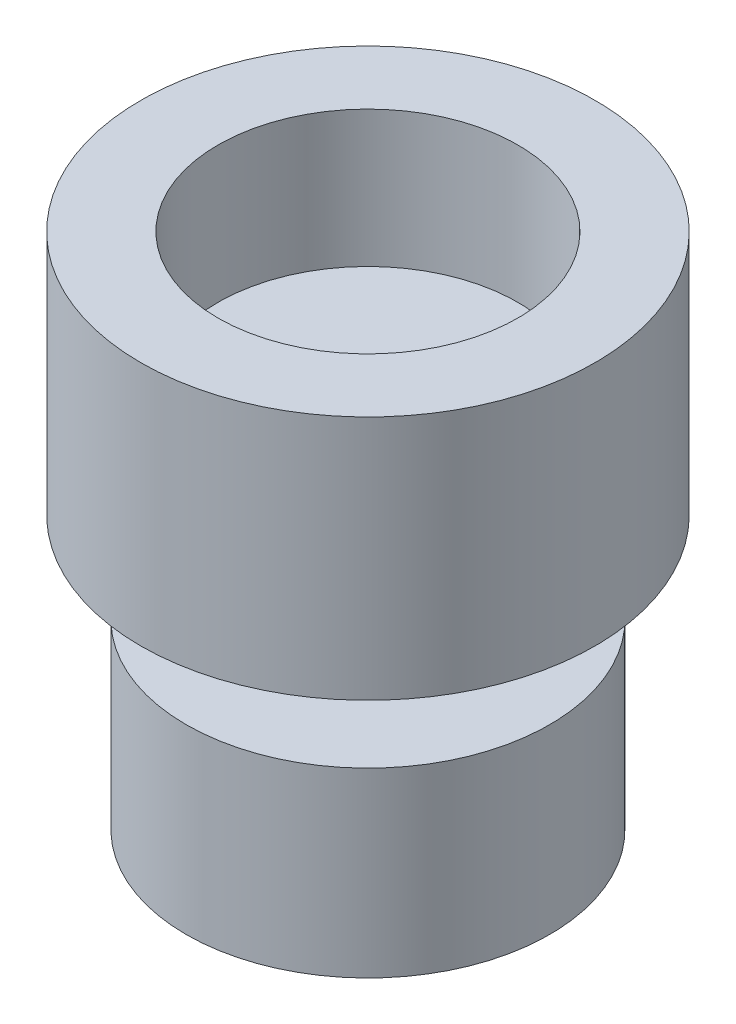
ISO-10303-21;
HEADER;
FILE_DESCRIPTION(('STEP AP214'),'2;1');
FILE_NAME('part.step','',(''),(''),'','','');
FILE_SCHEMA(('AUTOMOTIVE_DESIGN { 1 0 10303 214 1 1 1 1 }'));
ENDSEC;
DATA;
#1=APPLICATION_CONTEXT('core data for automotive mechanical design processes');
#2=APPLICATION_PROTOCOL_DEFINITION('international standard','automotive_design',2000,#1);
#3=PRODUCT_CONTEXT('',#1,'mechanical');
#4=PRODUCT('Part','Part','',(#3));
#5=PRODUCT_RELATED_PRODUCT_CATEGORY('part','',(#4));
#6=PRODUCT_DEFINITION_FORMATION('','',#4);
#7=PRODUCT_DEFINITION_CONTEXT('part definition',#1,'design');
#8=PRODUCT_DEFINITION('design','',#6,#7);
#9=PRODUCT_DEFINITION_SHAPE('','',#8);
#10=(LENGTH_UNIT() NAMED_UNIT(*) SI_UNIT(.MILLI.,.METRE.));
#11=(NAMED_UNIT(*) PLANE_ANGLE_UNIT() SI_UNIT($,.RADIAN.));
#12=(NAMED_UNIT(*) SI_UNIT($,.STERADIAN.) SOLID_ANGLE_UNIT());
#13=UNCERTAINTY_MEASURE_WITH_UNIT(LENGTH_MEASURE(1.E-05),#10,'distance_accuracy_value','');
#14=(GEOMETRIC_REPRESENTATION_CONTEXT(3) GLOBAL_UNCERTAINTY_ASSIGNED_CONTEXT((#13)) GLOBAL_UNIT_ASSIGNED_CONTEXT((#10,
#11,#12)) REPRESENTATION_CONTEXT('',''));
#15=CARTESIAN_POINT('',(0.,0.,0.));
#16=DIRECTION('',(0.,0.,1.));
#17=DIRECTION('',(1.,0.,0.));
#18=AXIS2_PLACEMENT_3D('',#15,#16,#17);
#19=CARTESIAN_POINT('',(-0.522013311509166,2.7,-0.51113803418606));
#20=DIRECTION('',(0.,-1.,0.));
#21=DIRECTION('',(0.,0.,-1.));
#22=AXIS2_PLACEMENT_3D('',#19,#20,#21);
#23=CYLINDRICAL_SURFACE('',#22,2.5);
#24=CARTESIAN_POINT('',(-0.522013311509166,2.7,-0.51113803418606));
#25=DIRECTION('',(0.,1.,0.));
#26=DIRECTION('',(0.,0.,1.));
#27=AXIS2_PLACEMENT_3D('',#24,#25,#26);
#28=CIRCLE('',#27,2.5);
#29=CARTESIAN_POINT('',(-0.522013311509166,2.7,1.98886196581394));
#30=VERTEX_POINT('',#29);
#31=EDGE_CURVE('E50',#30,#30,#28,.T.);
#32=ORIENTED_EDGE('',*,*,#31,.F.);
#33=EDGE_LOOP('',(#32));
#34=FACE_BOUND('',#33,.T.);
#35=CARTESIAN_POINT('',(-0.522013311509166,0.,-0.51113803418606));
#36=DIRECTION('',(0.,1.,0.));
#37=DIRECTION('',(0.,0.,1.));
#38=AXIS2_PLACEMENT_3D('',#35,#36,#37);
#39=CIRCLE('',#38,2.5);
#40=CARTESIAN_POINT('',(-0.522013311509166,0.,1.98886196581394));
#41=VERTEX_POINT('',#40);
#42=EDGE_CURVE('E46',#41,#41,#39,.T.);
#43=ORIENTED_EDGE('',*,*,#42,.T.);
#44=EDGE_LOOP('',(#43));
#45=FACE_BOUND('',#44,.T.);
#46=ADVANCED_FACE('F43',(#34,#45),#23,.T.);
#47=CARTESIAN_POINT('',(-0.522013311509166,2.7,-0.51113803418606));
#48=DIRECTION('',(0.,1.,0.));
#49=DIRECTION('',(0.,0.,1.));
#50=AXIS2_PLACEMENT_3D('',#47,#48,#49);
#51=PLANE('',#50);
#52=CARTESIAN_POINT('',(-0.522013311509166,2.7,-0.51113803418606));
#53=DIRECTION('',(0.,1.,0.));
#54=DIRECTION('',(0.,0.,1.));
#55=AXIS2_PLACEMENT_3D('',#52,#53,#54);
#56=CIRCLE('',#55,1.65);
#57=CARTESIAN_POINT('',(-0.522013311509166,2.7,1.13886196581394));
#58=VERTEX_POINT('',#57);
#59=EDGE_CURVE('E66',#58,#58,#56,.T.);
#60=ORIENTED_EDGE('',*,*,#59,.F.);
#61=EDGE_LOOP('',(#60));
#62=FACE_BOUND('',#61,.T.);
#63=ORIENTED_EDGE('',*,*,#31,.T.);
#64=EDGE_LOOP('',(#63));
#65=FACE_BOUND('',#64,.T.);
#66=ADVANCED_FACE('F81',(#62,#65),#51,.T.);
#67=CARTESIAN_POINT('',(-0.522013311509166,0.,-0.51113803418606));
#68=DIRECTION('',(0.,1.,0.));
#69=DIRECTION('',(0.,0.,1.));
#70=AXIS2_PLACEMENT_3D('',#67,#68,#69);
#71=PLANE('',#70);
#72=CARTESIAN_POINT('',(-0.522013311509166,0.,-0.51113803418606));
#73=DIRECTION('',(0.,-1.,0.));
#74=DIRECTION('',(0.,0.,-1.));
#75=AXIS2_PLACEMENT_3D('',#72,#73,#74);
#76=CIRCLE('',#75,1.);
#77=CARTESIAN_POINT('',(-0.522013311509166,0.,-1.51113803418606));
#78=VERTEX_POINT('',#77);
#79=EDGE_CURVE('E10',#78,#78,#76,.T.);
#80=ORIENTED_EDGE('',*,*,#79,.F.);
#81=EDGE_LOOP('',(#80));
#82=FACE_BOUND('',#81,.T.);
#83=ORIENTED_EDGE('',*,*,#42,.F.);
#84=EDGE_LOOP('',(#83));
#85=FACE_BOUND('',#84,.T.);
#86=ADVANCED_FACE('F84',(#82,#85),#71,.F.);
#87=CARTESIAN_POINT('',(-0.522013311509166,-1.,-0.51113803418606));
#88=DIRECTION('',(0.,1.,0.));
#89=DIRECTION('',(0.,0.,1.));
#90=AXIS2_PLACEMENT_3D('',#87,#88,#89);
#91=CYLINDRICAL_SURFACE('',#90,1.);
#92=CARTESIAN_POINT('',(-0.522013311509166,-1.,-0.51113803418606));
#93=DIRECTION('',(0.,-1.,0.));
#94=DIRECTION('',(0.,0.,-1.));
#95=AXIS2_PLACEMENT_3D('',#92,#93,#94);
#96=CIRCLE('',#95,1.);
#97=CARTESIAN_POINT('',(-0.522013311509166,-1.,-1.51113803418606));
#98=VERTEX_POINT('',#97);
#99=EDGE_CURVE('E56',#98,#98,#96,.T.);
#100=ORIENTED_EDGE('',*,*,#99,.F.);
#101=EDGE_LOOP('',(#100));
#102=FACE_BOUND('',#101,.T.);
#103=ORIENTED_EDGE('',*,*,#79,.T.);
#104=EDGE_LOOP('',(#103));
#105=FACE_BOUND('',#104,.T.);
#106=ADVANCED_FACE('F94',(#102,#105),#91,.T.);
#107=CARTESIAN_POINT('',(-0.522013311509166,-3.,-0.51113803418606));
#108=DIRECTION('',(0.,1.,0.));
#109=DIRECTION('',(0.,0.,1.));
#110=AXIS2_PLACEMENT_3D('',#107,#108,#109);
#111=CYLINDRICAL_SURFACE('',#110,2.);
#112=CARTESIAN_POINT('',(-0.522013311509166,-3.,-0.51113803418606));
#113=DIRECTION('',(0.,-1.,0.));
#114=DIRECTION('',(0.,0.,-1.));
#115=AXIS2_PLACEMENT_3D('',#112,#113,#114);
#116=CIRCLE('',#115,2.);
#117=CARTESIAN_POINT('',(-0.522013311509166,-3.,-2.51113803418606));
#118=VERTEX_POINT('',#117);
#119=EDGE_CURVE('E59',#118,#118,#116,.T.);
#120=ORIENTED_EDGE('',*,*,#119,.F.);
#121=EDGE_LOOP('',(#120));
#122=FACE_BOUND('',#121,.T.);
#123=CARTESIAN_POINT('',(-0.522013311509166,-1.,-0.51113803418606));
#124=DIRECTION('',(0.,-1.,0.));
#125=DIRECTION('',(0.,0.,-1.));
#126=AXIS2_PLACEMENT_3D('',#123,#124,#125);
#127=CIRCLE('',#126,2.);
#128=CARTESIAN_POINT('',(-0.522013311509166,-1.,-2.51113803418606));
#129=VERTEX_POINT('',#128);
#130=EDGE_CURVE('E60',#129,#129,#127,.T.);
#131=ORIENTED_EDGE('',*,*,#130,.T.);
#132=EDGE_LOOP('',(#131));
#133=FACE_BOUND('',#132,.T.);
#134=ADVANCED_FACE('F99',(#122,#133),#111,.T.);
#135=CARTESIAN_POINT('',(-0.522013311509166,-3.,-0.51113803418606));
#136=DIRECTION('',(0.,-1.,0.));
#137=DIRECTION('',(0.,0.,-1.));
#138=AXIS2_PLACEMENT_3D('',#135,#136,#137);
#139=PLANE('',#138);
#140=ORIENTED_EDGE('',*,*,#119,.T.);
#141=EDGE_LOOP('',(#140));
#142=FACE_BOUND('',#141,.T.);
#143=ADVANCED_FACE('F105',(#142),#139,.T.);
#144=CARTESIAN_POINT('',(-0.522013311509166,-1.,-0.51113803418606));
#145=DIRECTION('',(0.,-1.,0.));
#146=DIRECTION('',(0.,0.,-1.));
#147=AXIS2_PLACEMENT_3D('',#144,#145,#146);
#148=PLANE('',#147);
#149=ORIENTED_EDGE('',*,*,#99,.T.);
#150=EDGE_LOOP('',(#149));
#151=FACE_BOUND('',#150,.T.);
#152=ORIENTED_EDGE('',*,*,#130,.F.);
#153=EDGE_LOOP('',(#152));
#154=FACE_BOUND('',#153,.T.);
#155=ADVANCED_FACE('F77',(#151,#154),#148,.F.);
#156=CARTESIAN_POINT('',(-0.522013311509166,1.2,-0.51113803418606));
#157=DIRECTION('',(0.,1.,0.));
#158=DIRECTION('',(0.,0.,1.));
#159=AXIS2_PLACEMENT_3D('',#156,#157,#158);
#160=CYLINDRICAL_SURFACE('',#159,1.65);
#161=CARTESIAN_POINT('',(-0.522013311509166,1.2,-0.51113803418606));
#162=DIRECTION('',(0.,1.,0.));
#163=DIRECTION('',(0.,0.,1.));
#164=AXIS2_PLACEMENT_3D('',#161,#162,#163);
#165=CIRCLE('',#164,1.65);
#166=CARTESIAN_POINT('',(-0.522013311509166,1.2,1.13886196581394));
#167=VERTEX_POINT('',#166);
#168=EDGE_CURVE('E63',#167,#167,#165,.T.);
#169=ORIENTED_EDGE('',*,*,#168,.F.);
#170=EDGE_LOOP('',(#169));
#171=FACE_BOUND('',#170,.T.);
#172=ORIENTED_EDGE('',*,*,#59,.T.);
#173=EDGE_LOOP('',(#172));
#174=FACE_BOUND('',#173,.T.);
#175=ADVANCED_FACE('F74',(#171,#174),#160,.F.);
#176=CARTESIAN_POINT('',(-0.522013311509166,1.2,-0.51113803418606));
#177=DIRECTION('',(0.,1.,0.));
#178=DIRECTION('',(0.,0.,1.));
#179=AXIS2_PLACEMENT_3D('',#176,#177,#178);
#180=PLANE('',#179);
#181=ORIENTED_EDGE('',*,*,#168,.T.);
#182=EDGE_LOOP('',(#181));
#183=FACE_BOUND('',#182,.T.);
#184=ADVANCED_FACE('F72',(#183),#180,.T.);
#185=CLOSED_SHELL('',(#46,#66,#86,#106,#134,#143,#155,#175,#184));
#186=MANIFOLD_SOLID_BREP('B2',#185);
#187=ADVANCED_BREP_SHAPE_REPRESENTATION('',(#18,#186),#14);
#188=SHAPE_DEFINITION_REPRESENTATION(#9,#187);
ENDSEC;
END-ISO-10303-21;
